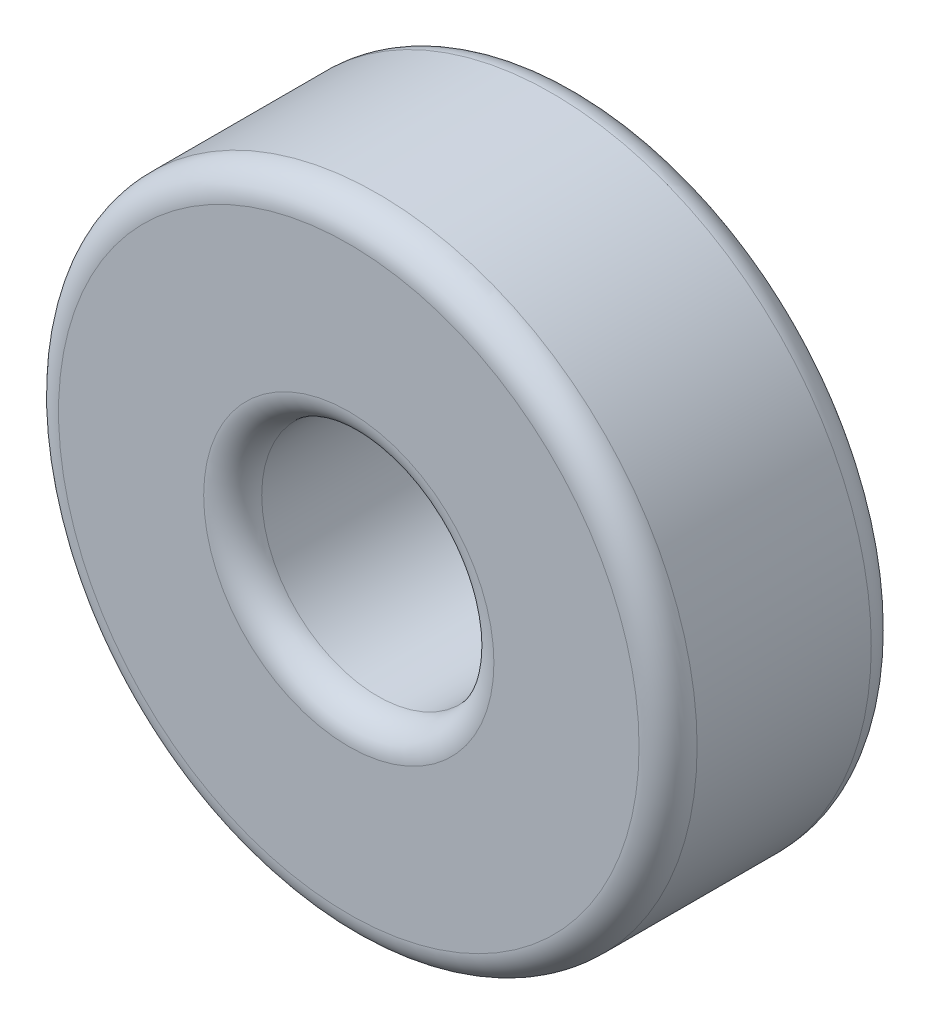
ISO-10303-21;
HEADER;
FILE_DESCRIPTION(('STEP AP214'),'2;1');
FILE_NAME('part.step','',(''),(''),'','','');
FILE_SCHEMA(('AUTOMOTIVE_DESIGN { 1 0 10303 214 1 1 1 1 }'));
ENDSEC;
DATA;
#1=APPLICATION_CONTEXT('core data for automotive mechanical design processes');
#2=APPLICATION_PROTOCOL_DEFINITION('international standard','automotive_design',2000,#1);
#3=PRODUCT_CONTEXT('',#1,'mechanical');
#4=PRODUCT('Part','Part','',(#3));
#5=PRODUCT_RELATED_PRODUCT_CATEGORY('part','',(#4));
#6=PRODUCT_DEFINITION_FORMATION('','',#4);
#7=PRODUCT_DEFINITION_CONTEXT('part definition',#1,'design');
#8=PRODUCT_DEFINITION('design','',#6,#7);
#9=PRODUCT_DEFINITION_SHAPE('','',#8);
#10=(LENGTH_UNIT() NAMED_UNIT(*) SI_UNIT(.MILLI.,.METRE.));
#11=(NAMED_UNIT(*) PLANE_ANGLE_UNIT() SI_UNIT($,.RADIAN.));
#12=(NAMED_UNIT(*) SI_UNIT($,.STERADIAN.) SOLID_ANGLE_UNIT());
#13=UNCERTAINTY_MEASURE_WITH_UNIT(LENGTH_MEASURE(1.E-05),#10,'distance_accuracy_value','');
#14=(GEOMETRIC_REPRESENTATION_CONTEXT(3) GLOBAL_UNCERTAINTY_ASSIGNED_CONTEXT((#13)) GLOBAL_UNIT_ASSIGNED_CONTEXT((#10,
#11,#12)) REPRESENTATION_CONTEXT('',''));
#15=CARTESIAN_POINT('',(0.,0.,0.));
#16=DIRECTION('',(0.,0.,1.));
#17=DIRECTION('',(1.,0.,0.));
#18=AXIS2_PLACEMENT_3D('',#15,#16,#17);
#19=CARTESIAN_POINT('',(0.,0.,4.00000000000002));
#20=DIRECTION('',(0.,0.,1.));
#21=DIRECTION('',(1.,0.,0.));
#22=AXIS2_PLACEMENT_3D('',#19,#20,#21);
#23=PLANE('',#22);
#24=CARTESIAN_POINT('',(0.,0.,4.00000000000002));
#25=DIRECTION('',(0.,0.,1.));
#26=DIRECTION('',(1.,0.,0.));
#27=AXIS2_PLACEMENT_3D('',#24,#25,#26);
#28=CIRCLE('',#27,2.5);
#29=CARTESIAN_POINT('',(2.50000000000007,0.,4.00000000000002));
#30=VERTEX_POINT('',#29);
#31=EDGE_CURVE('E10',#30,#30,#28,.F.);
#32=ORIENTED_EDGE('',*,*,#31,.T.);
#33=EDGE_LOOP('',(#32));
#34=FACE_BOUND('',#33,.T.);
#35=CARTESIAN_POINT('',(0.,0.,4.00000000000002));
#36=DIRECTION('',(0.,0.,1.));
#37=DIRECTION('',(1.,0.,0.));
#38=AXIS2_PLACEMENT_3D('',#35,#36,#37);
#39=CIRCLE('',#38,5.);
#40=CARTESIAN_POINT('',(5.00000000000007,0.,4.00000000000002));
#41=VERTEX_POINT('',#40);
#42=EDGE_CURVE('E36',#41,#41,#39,.T.);
#43=ORIENTED_EDGE('',*,*,#42,.T.);
#44=EDGE_LOOP('',(#43));
#45=FACE_BOUND('',#44,.T.);
#46=ADVANCED_FACE('F29',(#34,#45),#23,.T.);
#47=CARTESIAN_POINT('',(0.,0.,0.));
#48=DIRECTION('',(0.,0.,1.));
#49=DIRECTION('',(1.,0.,0.));
#50=AXIS2_PLACEMENT_3D('',#47,#48,#49);
#51=PLANE('',#50);
#52=CARTESIAN_POINT('',(0.,0.,0.));
#53=DIRECTION('',(0.,0.,1.));
#54=DIRECTION('',(1.,0.,0.));
#55=AXIS2_PLACEMENT_3D('',#52,#53,#54);
#56=CIRCLE('',#55,2.5);
#57=CARTESIAN_POINT('',(2.50000000000009,0.,0.));
#58=VERTEX_POINT('',#57);
#59=EDGE_CURVE('E55',#58,#58,#56,.T.);
#60=ORIENTED_EDGE('',*,*,#59,.T.);
#61=EDGE_LOOP('',(#60));
#62=FACE_BOUND('',#61,.T.);
#63=CARTESIAN_POINT('',(0.,0.,0.));
#64=DIRECTION('',(0.,0.,1.));
#65=DIRECTION('',(1.,0.,0.));
#66=AXIS2_PLACEMENT_3D('',#63,#64,#65);
#67=CIRCLE('',#66,5.);
#68=CARTESIAN_POINT('',(5.00000000000009,0.,0.));
#69=VERTEX_POINT('',#68);
#70=EDGE_CURVE('E58',#69,#69,#67,.F.);
#71=ORIENTED_EDGE('',*,*,#70,.T.);
#72=EDGE_LOOP('',(#71));
#73=FACE_BOUND('',#72,.T.);
#74=ADVANCED_FACE('F62',(#62,#73),#51,.F.);
#75=CARTESIAN_POINT('',(0.,0.,4.00000000000002));
#76=DIRECTION('',(0.,0.,-1.));
#77=DIRECTION('',(-1.,0.,0.));
#78=AXIS2_PLACEMENT_3D('',#75,#76,#77);
#79=CYLINDRICAL_SURFACE('',#78,5.5);
#80=CARTESIAN_POINT('',(0.,0.,0.5));
#81=DIRECTION('',(0.,0.,1.));
#82=DIRECTION('',(1.,0.,0.));
#83=AXIS2_PLACEMENT_3D('',#80,#81,#82);
#84=CIRCLE('',#83,5.5);
#85=CARTESIAN_POINT('',(5.50000000000009,0.,0.5));
#86=VERTEX_POINT('',#85);
#87=EDGE_CURVE('E40',#86,#86,#84,.T.);
#88=ORIENTED_EDGE('',*,*,#87,.T.);
#89=EDGE_LOOP('',(#88));
#90=FACE_BOUND('',#89,.T.);
#91=CARTESIAN_POINT('',(0.,0.,3.50000000000002));
#92=DIRECTION('',(0.,0.,1.));
#93=DIRECTION('',(1.,0.,0.));
#94=AXIS2_PLACEMENT_3D('',#91,#92,#93);
#95=CIRCLE('',#94,5.5);
#96=CARTESIAN_POINT('',(5.50000000000008,0.,3.50000000000002));
#97=VERTEX_POINT('',#96);
#98=EDGE_CURVE('E44',#97,#97,#95,.F.);
#99=ORIENTED_EDGE('',*,*,#98,.T.);
#100=EDGE_LOOP('',(#99));
#101=FACE_BOUND('',#100,.T.);
#102=ADVANCED_FACE('F31',(#90,#101),#79,.T.);
#103=CARTESIAN_POINT('',(0.,0.,4.00000000000002));
#104=DIRECTION('',(0.,0.,-1.));
#105=DIRECTION('',(-1.,0.,0.));
#106=AXIS2_PLACEMENT_3D('',#103,#104,#105);
#107=CYLINDRICAL_SURFACE('',#106,2.);
#108=CARTESIAN_POINT('',(0.,0.,0.5));
#109=DIRECTION('',(0.,0.,1.));
#110=DIRECTION('',(1.,0.,0.));
#111=AXIS2_PLACEMENT_3D('',#108,#109,#110);
#112=CIRCLE('',#111,2.);
#113=CARTESIAN_POINT('',(2.00000000000009,0.,0.5));
#114=VERTEX_POINT('',#113);
#115=EDGE_CURVE('E49',#114,#114,#112,.F.);
#116=ORIENTED_EDGE('',*,*,#115,.T.);
#117=EDGE_LOOP('',(#116));
#118=FACE_BOUND('',#117,.T.);
#119=CARTESIAN_POINT('',(0.,0.,3.50000000000002));
#120=DIRECTION('',(0.,0.,1.));
#121=DIRECTION('',(1.,0.,0.));
#122=AXIS2_PLACEMENT_3D('',#119,#120,#121);
#123=CIRCLE('',#122,2.);
#124=CARTESIAN_POINT('',(2.00000000000007,0.,3.50000000000002));
#125=VERTEX_POINT('',#124);
#126=EDGE_CURVE('E52',#125,#125,#123,.T.);
#127=ORIENTED_EDGE('',*,*,#126,.T.);
#128=EDGE_LOOP('',(#127));
#129=FACE_BOUND('',#128,.T.);
#130=ADVANCED_FACE('F74',(#118,#129),#107,.F.);
#131=CARTESIAN_POINT('',(0.,0.,0.5));
#132=DIRECTION('',(0.,0.,1.));
#133=DIRECTION('',(1.,0.,0.));
#134=AXIS2_PLACEMENT_3D('',#131,#132,#133);
#135=TOROIDAL_SURFACE('',#134,2.5,0.5);
#136=ORIENTED_EDGE('',*,*,#115,.F.);
#137=EDGE_LOOP('',(#136));
#138=FACE_BOUND('',#137,.T.);
#139=ORIENTED_EDGE('',*,*,#59,.F.);
#140=EDGE_LOOP('',(#139));
#141=FACE_BOUND('',#140,.T.);
#142=ADVANCED_FACE('F68',(#138,#141),#135,.T.);
#143=CARTESIAN_POINT('',(0.,0.,0.5));
#144=DIRECTION('',(0.,0.,1.));
#145=DIRECTION('',(1.,0.,0.));
#146=AXIS2_PLACEMENT_3D('',#143,#144,#145);
#147=TOROIDAL_SURFACE('',#146,5.,0.5);
#148=ORIENTED_EDGE('',*,*,#70,.F.);
#149=EDGE_LOOP('',(#148));
#150=FACE_BOUND('',#149,.T.);
#151=ORIENTED_EDGE('',*,*,#87,.F.);
#152=EDGE_LOOP('',(#151));
#153=FACE_BOUND('',#152,.T.);
#154=ADVANCED_FACE('F64',(#150,#153),#147,.T.);
#155=CARTESIAN_POINT('',(0.,0.,3.50000000000002));
#156=DIRECTION('',(0.,0.,1.));
#157=DIRECTION('',(1.,0.,0.));
#158=AXIS2_PLACEMENT_3D('',#155,#156,#157);
#159=TOROIDAL_SURFACE('',#158,2.5,0.5);
#160=ORIENTED_EDGE('',*,*,#31,.F.);
#161=EDGE_LOOP('',(#160));
#162=FACE_BOUND('',#161,.T.);
#163=ORIENTED_EDGE('',*,*,#126,.F.);
#164=EDGE_LOOP('',(#163));
#165=FACE_BOUND('',#164,.T.);
#166=ADVANCED_FACE('F67',(#162,#165),#159,.T.);
#167=CARTESIAN_POINT('',(0.,0.,3.50000000000002));
#168=DIRECTION('',(0.,0.,1.));
#169=DIRECTION('',(1.,0.,0.));
#170=AXIS2_PLACEMENT_3D('',#167,#168,#169);
#171=TOROIDAL_SURFACE('',#170,5.,0.5);
#172=ORIENTED_EDGE('',*,*,#98,.F.);
#173=EDGE_LOOP('',(#172));
#174=FACE_BOUND('',#173,.T.);
#175=ORIENTED_EDGE('',*,*,#42,.F.);
#176=EDGE_LOOP('',(#175));
#177=FACE_BOUND('',#176,.T.);
#178=ADVANCED_FACE('F77',(#174,#177),#171,.T.);
#179=CLOSED_SHELL('',(#46,#74,#102,#130,#142,#154,#166,#178));
#180=MANIFOLD_SOLID_BREP('B2',#179);
#181=ADVANCED_BREP_SHAPE_REPRESENTATION('',(#18,#180),#14);
#182=SHAPE_DEFINITION_REPRESENTATION(#9,#181);
ENDSEC;
END-ISO-10303-21;
